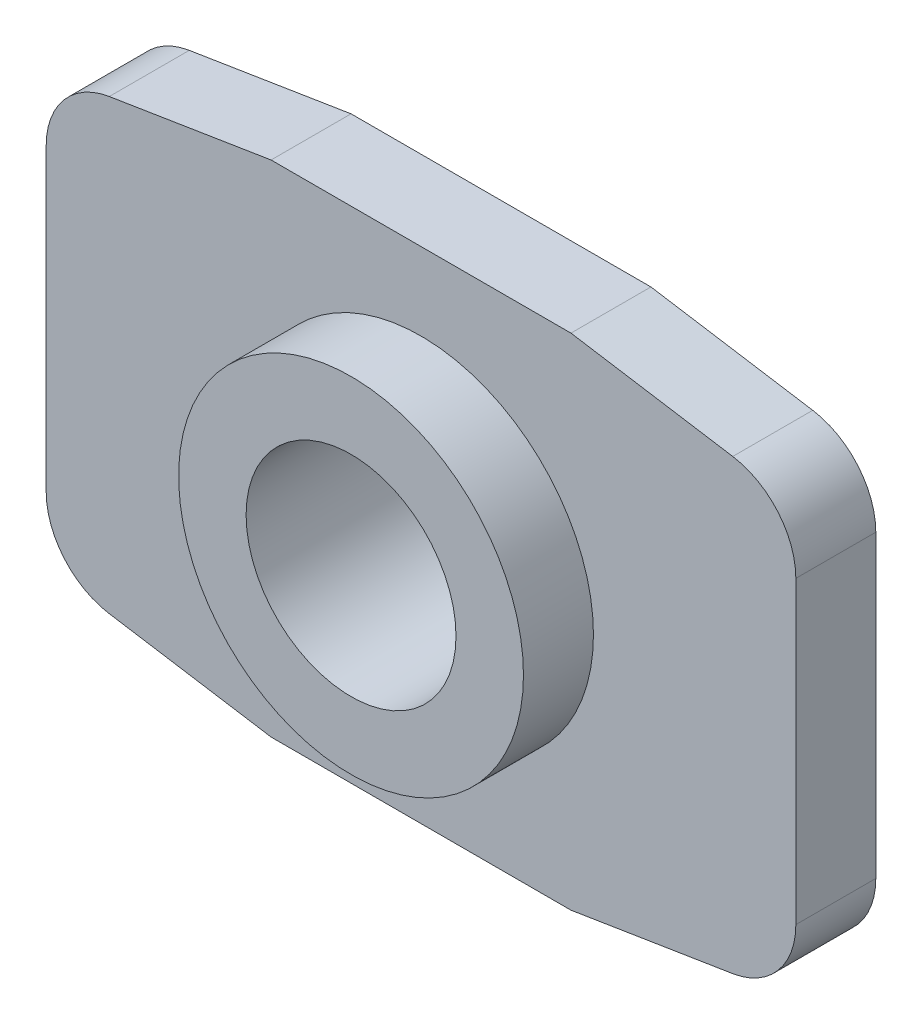
ISO-10303-21;
HEADER;
FILE_DESCRIPTION(('STEP AP214'),'2;1');
FILE_NAME('part.step','',(''),(''),'','','');
FILE_SCHEMA(('AUTOMOTIVE_DESIGN { 1 0 10303 214 1 1 1 1 }'));
ENDSEC;
DATA;
#1=APPLICATION_CONTEXT('core data for automotive mechanical design processes');
#2=APPLICATION_PROTOCOL_DEFINITION('international standard','automotive_design',2000,#1);
#3=PRODUCT_CONTEXT('',#1,'mechanical');
#4=PRODUCT('Part','Part','',(#3));
#5=PRODUCT_RELATED_PRODUCT_CATEGORY('part','',(#4));
#6=PRODUCT_DEFINITION_FORMATION('','',#4);
#7=PRODUCT_DEFINITION_CONTEXT('part definition',#1,'design');
#8=PRODUCT_DEFINITION('design','',#6,#7);
#9=PRODUCT_DEFINITION_SHAPE('','',#8);
#10=(LENGTH_UNIT() NAMED_UNIT(*) SI_UNIT(.MILLI.,.METRE.));
#11=(NAMED_UNIT(*) PLANE_ANGLE_UNIT() SI_UNIT($,.RADIAN.));
#12=(NAMED_UNIT(*) SI_UNIT($,.STERADIAN.) SOLID_ANGLE_UNIT());
#13=UNCERTAINTY_MEASURE_WITH_UNIT(LENGTH_MEASURE(1.E-05),#10,'distance_accuracy_value','');
#14=(GEOMETRIC_REPRESENTATION_CONTEXT(3) GLOBAL_UNCERTAINTY_ASSIGNED_CONTEXT((#13)) GLOBAL_UNIT_ASSIGNED_CONTEXT((#10,
#11,#12)) REPRESENTATION_CONTEXT('',''));
#15=CARTESIAN_POINT('',(0.,0.,0.));
#16=DIRECTION('',(0.,0.,1.));
#17=DIRECTION('',(1.,0.,0.));
#18=AXIS2_PLACEMENT_3D('',#15,#16,#17);
#19=CARTESIAN_POINT('',(6.,3.,1.6));
#20=DIRECTION('',(0.,0.,1.));
#21=DIRECTION('',(1.,0.,0.));
#22=AXIS2_PLACEMENT_3D('',#19,#20,#21);
#23=PLANE('',#22);
#24=CARTESIAN_POINT('',(6.,3.,1.6));
#25=DIRECTION('',(0.,0.,1.));
#26=DIRECTION('',(1.,0.,0.));
#27=AXIS2_PLACEMENT_3D('',#24,#25,#26);
#28=CIRCLE('',#27,1.5);
#29=CARTESIAN_POINT('',(7.5,3.,1.6));
#30=VERTEX_POINT('',#29);
#31=CARTESIAN_POINT('',(6.23739675280407,4.48109512920611,1.6));
#32=VERTEX_POINT('',#31);
#33=EDGE_CURVE('E182',#30,#32,#28,.T.);
#34=ORIENTED_EDGE('',*,*,#33,.T.);
#35=DIRECTION('',(-0.987396752804077,0.158264501869385,0.));
#36=VECTOR('',#35,1.);
#37=CARTESIAN_POINT('',(6.23739675280407,4.48109512920611,1.6));
#38=LINE('',#37,#36);
#39=CARTESIAN_POINT('',(3.,5.,1.6));
#40=VERTEX_POINT('',#39);
#41=EDGE_CURVE('E110',#32,#40,#38,.T.);
#42=ORIENTED_EDGE('',*,*,#41,.T.);
#43=DIRECTION('',(-1.,0.,0.));
#44=VECTOR('',#43,1.);
#45=CARTESIAN_POINT('',(-3.,5.,1.6));
#46=LINE('',#45,#44);
#47=CARTESIAN_POINT('',(-3.,5.,1.6));
#48=VERTEX_POINT('',#47);
#49=EDGE_CURVE('E209',#40,#48,#46,.T.);
#50=ORIENTED_EDGE('',*,*,#49,.T.);
#51=DIRECTION('',(-0.987396752804077,-0.158264501869386,0.));
#52=VECTOR('',#51,1.);
#53=CARTESIAN_POINT('',(-6.23739675280407,4.48109512920611,1.6));
#54=LINE('',#53,#52);
#55=CARTESIAN_POINT('',(-6.23739675280407,4.48109512920611,1.6));
#56=VERTEX_POINT('',#55);
#57=EDGE_CURVE('E227',#48,#56,#54,.T.);
#58=ORIENTED_EDGE('',*,*,#57,.T.);
#59=CARTESIAN_POINT('',(-6.,3.,1.6));
#60=DIRECTION('',(0.,0.,1.));
#61=DIRECTION('',(-1.,0.,0.));
#62=AXIS2_PLACEMENT_3D('',#59,#60,#61);
#63=CIRCLE('',#62,1.5);
#64=CARTESIAN_POINT('',(-7.5,3.,1.6));
#65=VERTEX_POINT('',#64);
#66=EDGE_CURVE('E224',#56,#65,#63,.T.);
#67=ORIENTED_EDGE('',*,*,#66,.T.);
#68=DIRECTION('',(0.,-1.,0.));
#69=VECTOR('',#68,1.);
#70=CARTESIAN_POINT('',(-7.5,-3.,1.6));
#71=LINE('',#70,#69);
#72=CARTESIAN_POINT('',(-7.5,-3.,1.6));
#73=VERTEX_POINT('',#72);
#74=EDGE_CURVE('E226',#65,#73,#71,.T.);
#75=ORIENTED_EDGE('',*,*,#74,.T.);
#76=CARTESIAN_POINT('',(-6.,-3.,1.6));
#77=DIRECTION('',(0.,0.,1.));
#78=DIRECTION('',(1.,0.,0.));
#79=AXIS2_PLACEMENT_3D('',#76,#77,#78);
#80=CIRCLE('',#79,1.5);
#81=CARTESIAN_POINT('',(-6.23739675280407,-4.48109512920612,1.6));
#82=VERTEX_POINT('',#81);
#83=EDGE_CURVE('E229',#73,#82,#80,.T.);
#84=ORIENTED_EDGE('',*,*,#83,.T.);
#85=DIRECTION('',(0.987396752804077,-0.158264501869385,0.));
#86=VECTOR('',#85,1.);
#87=CARTESIAN_POINT('',(-6.23739675280407,-4.48109512920612,1.6));
#88=LINE('',#87,#86);
#89=CARTESIAN_POINT('',(-3.,-5.,1.6));
#90=VERTEX_POINT('',#89);
#91=EDGE_CURVE('E235',#82,#90,#88,.T.);
#92=ORIENTED_EDGE('',*,*,#91,.T.);
#93=DIRECTION('',(1.,0.,0.));
#94=VECTOR('',#93,1.);
#95=CARTESIAN_POINT('',(-3.,-5.,1.6));
#96=LINE('',#95,#94);
#97=CARTESIAN_POINT('',(3.,-5.,1.6));
#98=VERTEX_POINT('',#97);
#99=EDGE_CURVE('E141',#90,#98,#96,.T.);
#100=ORIENTED_EDGE('',*,*,#99,.T.);
#101=DIRECTION('',(0.987396752804077,0.158264501869385,0.));
#102=VECTOR('',#101,1.);
#103=CARTESIAN_POINT('',(6.23739675280407,-4.48109512920611,1.6));
#104=LINE('',#103,#102);
#105=CARTESIAN_POINT('',(6.23739675280407,-4.48109512920612,1.6));
#106=VERTEX_POINT('',#105);
#107=EDGE_CURVE('E135',#98,#106,#104,.T.);
#108=ORIENTED_EDGE('',*,*,#107,.T.);
#109=CARTESIAN_POINT('',(6.,-3.,1.6));
#110=DIRECTION('',(0.,0.,1.));
#111=DIRECTION('',(-1.,0.,0.));
#112=AXIS2_PLACEMENT_3D('',#109,#110,#111);
#113=CIRCLE('',#112,1.5);
#114=CARTESIAN_POINT('',(7.5,-3.,1.6));
#115=VERTEX_POINT('',#114);
#116=EDGE_CURVE('E139',#106,#115,#113,.T.);
#117=ORIENTED_EDGE('',*,*,#116,.T.);
#118=DIRECTION('',(0.,1.,0.));
#119=VECTOR('',#118,1.);
#120=CARTESIAN_POINT('',(7.5,-3.,1.6));
#121=LINE('',#120,#119);
#122=EDGE_CURVE('E55',#115,#30,#121,.T.);
#123=ORIENTED_EDGE('',*,*,#122,.T.);
#124=EDGE_LOOP('',(#34,#42,#50,#58,#67,#75,#84,#92,#100,#108,#117,#123));
#125=FACE_BOUND('',#124,.T.);
#126=CARTESIAN_POINT('',(0.,0.,1.6));
#127=DIRECTION('',(0.,0.,1.));
#128=DIRECTION('',(1.,0.,0.));
#129=AXIS2_PLACEMENT_3D('',#126,#127,#128);
#130=CIRCLE('',#129,3.45);
#131=CARTESIAN_POINT('',(3.45,0.,1.6));
#132=VERTEX_POINT('',#131);
#133=EDGE_CURVE('E287',#132,#132,#130,.T.);
#134=ORIENTED_EDGE('',*,*,#133,.F.);
#135=EDGE_LOOP('',(#134));
#136=FACE_BOUND('',#135,.T.);
#137=ADVANCED_FACE('F38',(#125,#136),#23,.T.);
#138=CARTESIAN_POINT('',(6.,3.,1.6));
#139=DIRECTION('',(0.,0.,-1.));
#140=DIRECTION('',(-1.,0.,0.));
#141=AXIS2_PLACEMENT_3D('',#138,#139,#140);
#142=CYLINDRICAL_SURFACE('',#141,1.5);
#143=CARTESIAN_POINT('',(6.,3.,0.));
#144=DIRECTION('',(0.,0.,1.));
#145=DIRECTION('',(1.,0.,0.));
#146=AXIS2_PLACEMENT_3D('',#143,#144,#145);
#147=CIRCLE('',#146,1.5);
#148=CARTESIAN_POINT('',(7.5,3.,0.));
#149=VERTEX_POINT('',#148);
#150=CARTESIAN_POINT('',(6.23739675280407,4.48109512920611,0.));
#151=VERTEX_POINT('',#150);
#152=EDGE_CURVE('E159',#149,#151,#147,.T.);
#153=ORIENTED_EDGE('',*,*,#152,.T.);
#154=DIRECTION('',(0.,0.,-1.));
#155=VECTOR('',#154,1.);
#156=CARTESIAN_POINT('',(6.23739675280407,4.48109512920611,1.6));
#157=LINE('',#156,#155);
#158=EDGE_CURVE('E11',#32,#151,#157,.T.);
#159=ORIENTED_EDGE('',*,*,#158,.F.);
#160=ORIENTED_EDGE('',*,*,#33,.F.);
#161=DIRECTION('',(0.,0.,-1.));
#162=VECTOR('',#161,1.);
#163=CARTESIAN_POINT('',(7.5,3.,1.6));
#164=LINE('',#163,#162);
#165=EDGE_CURVE('E155',#30,#149,#164,.T.);
#166=ORIENTED_EDGE('',*,*,#165,.T.);
#167=EDGE_LOOP('',(#153,#159,#160,#166));
#168=FACE_BOUND('',#167,.T.);
#169=ADVANCED_FACE('F40',(#168),#142,.T.);
#170=CARTESIAN_POINT('',(6.23739675280407,4.48109512920611,1.6));
#171=DIRECTION('',(-0.158264501869385,-0.987396752804077,0.));
#172=DIRECTION('',(0.987396752804077,-0.158264501869385,0.));
#173=AXIS2_PLACEMENT_3D('',#170,#171,#172);
#174=PLANE('',#173);
#175=DIRECTION('',(-0.987396752804077,0.158264501869385,0.));
#176=VECTOR('',#175,1.);
#177=CARTESIAN_POINT('',(6.23739675280407,4.48109512920611,0.));
#178=LINE('',#177,#176);
#179=CARTESIAN_POINT('',(3.,5.,0.));
#180=VERTEX_POINT('',#179);
#181=EDGE_CURVE('E162',#151,#180,#178,.T.);
#182=ORIENTED_EDGE('',*,*,#181,.T.);
#183=DIRECTION('',(0.,0.,-1.));
#184=VECTOR('',#183,1.);
#185=CARTESIAN_POINT('',(3.,5.,1.6));
#186=LINE('',#185,#184);
#187=EDGE_CURVE('E47',#40,#180,#186,.T.);
#188=ORIENTED_EDGE('',*,*,#187,.F.);
#189=ORIENTED_EDGE('',*,*,#41,.F.);
#190=ORIENTED_EDGE('',*,*,#158,.T.);
#191=EDGE_LOOP('',(#182,#188,#189,#190));
#192=FACE_BOUND('',#191,.T.);
#193=ADVANCED_FACE('F265',(#192),#174,.F.);
#194=CARTESIAN_POINT('',(-3.,5.,1.6));
#195=DIRECTION('',(0.,-1.,0.));
#196=DIRECTION('',(0.,0.,-1.));
#197=AXIS2_PLACEMENT_3D('',#194,#195,#196);
#198=PLANE('',#197);
#199=DIRECTION('',(-1.,0.,0.));
#200=VECTOR('',#199,1.);
#201=CARTESIAN_POINT('',(-3.,5.,0.));
#202=LINE('',#201,#200);
#203=CARTESIAN_POINT('',(-3.,5.,0.));
#204=VERTEX_POINT('',#203);
#205=EDGE_CURVE('E165',#180,#204,#202,.T.);
#206=ORIENTED_EDGE('',*,*,#205,.T.);
#207=DIRECTION('',(0.,0.,-1.));
#208=VECTOR('',#207,1.);
#209=CARTESIAN_POINT('',(-3.,5.,1.6));
#210=LINE('',#209,#208);
#211=EDGE_CURVE('E201',#48,#204,#210,.T.);
#212=ORIENTED_EDGE('',*,*,#211,.F.);
#213=ORIENTED_EDGE('',*,*,#49,.F.);
#214=ORIENTED_EDGE('',*,*,#187,.T.);
#215=EDGE_LOOP('',(#206,#212,#213,#214));
#216=FACE_BOUND('',#215,.T.);
#217=ADVANCED_FACE('F207',(#216),#198,.F.);
#218=CARTESIAN_POINT('',(-6.23739675280407,4.48109512920611,1.6));
#219=DIRECTION('',(0.158264501869386,-0.987396752804077,0.));
#220=DIRECTION('',(0.987396752804077,0.158264501869386,0.));
#221=AXIS2_PLACEMENT_3D('',#218,#219,#220);
#222=PLANE('',#221);
#223=DIRECTION('',(-0.987396752804077,-0.158264501869386,0.));
#224=VECTOR('',#223,1.);
#225=CARTESIAN_POINT('',(-6.23739675280407,4.48109512920611,0.));
#226=LINE('',#225,#224);
#227=CARTESIAN_POINT('',(-6.23739675280407,4.48109512920611,0.));
#228=VERTEX_POINT('',#227);
#229=EDGE_CURVE('E167',#204,#228,#226,.T.);
#230=ORIENTED_EDGE('',*,*,#229,.T.);
#231=DIRECTION('',(0.,0.,-1.));
#232=VECTOR('',#231,1.);
#233=CARTESIAN_POINT('',(-6.23739675280407,4.48109512920611,1.6));
#234=LINE('',#233,#232);
#235=EDGE_CURVE('E198',#56,#228,#234,.T.);
#236=ORIENTED_EDGE('',*,*,#235,.F.);
#237=ORIENTED_EDGE('',*,*,#57,.F.);
#238=ORIENTED_EDGE('',*,*,#211,.T.);
#239=EDGE_LOOP('',(#230,#236,#237,#238));
#240=FACE_BOUND('',#239,.T.);
#241=ADVANCED_FACE('F218',(#240),#222,.F.);
#242=CARTESIAN_POINT('',(-6.,3.,1.6));
#243=DIRECTION('',(0.,0.,-1.));
#244=DIRECTION('',(-1.,0.,0.));
#245=AXIS2_PLACEMENT_3D('',#242,#243,#244);
#246=CYLINDRICAL_SURFACE('',#245,1.5);
#247=CARTESIAN_POINT('',(-6.,3.,0.));
#248=DIRECTION('',(0.,0.,1.));
#249=DIRECTION('',(-1.,0.,0.));
#250=AXIS2_PLACEMENT_3D('',#247,#248,#249);
#251=CIRCLE('',#250,1.5);
#252=CARTESIAN_POINT('',(-7.5,3.,0.));
#253=VERTEX_POINT('',#252);
#254=EDGE_CURVE('E169',#228,#253,#251,.T.);
#255=ORIENTED_EDGE('',*,*,#254,.T.);
#256=DIRECTION('',(0.,0.,-1.));
#257=VECTOR('',#256,1.);
#258=CARTESIAN_POINT('',(-7.5,3.,1.6));
#259=LINE('',#258,#257);
#260=EDGE_CURVE('E195',#65,#253,#259,.T.);
#261=ORIENTED_EDGE('',*,*,#260,.F.);
#262=ORIENTED_EDGE('',*,*,#66,.F.);
#263=ORIENTED_EDGE('',*,*,#235,.T.);
#264=EDGE_LOOP('',(#255,#261,#262,#263));
#265=FACE_BOUND('',#264,.T.);
#266=ADVANCED_FACE('F222',(#265),#246,.T.);
#267=CARTESIAN_POINT('',(-7.5,-3.,1.6));
#268=DIRECTION('',(1.,0.,0.));
#269=DIRECTION('',(0.,0.,-1.));
#270=AXIS2_PLACEMENT_3D('',#267,#268,#269);
#271=PLANE('',#270);
#272=DIRECTION('',(0.,-1.,0.));
#273=VECTOR('',#272,1.);
#274=CARTESIAN_POINT('',(-7.5,-3.,0.));
#275=LINE('',#274,#273);
#276=CARTESIAN_POINT('',(-7.5,-3.,0.));
#277=VERTEX_POINT('',#276);
#278=EDGE_CURVE('E171',#253,#277,#275,.T.);
#279=ORIENTED_EDGE('',*,*,#278,.T.);
#280=DIRECTION('',(0.,0.,-1.));
#281=VECTOR('',#280,1.);
#282=CARTESIAN_POINT('',(-7.5,-3.,1.6));
#283=LINE('',#282,#281);
#284=EDGE_CURVE('E192',#73,#277,#283,.T.);
#285=ORIENTED_EDGE('',*,*,#284,.F.);
#286=ORIENTED_EDGE('',*,*,#74,.F.);
#287=ORIENTED_EDGE('',*,*,#260,.T.);
#288=EDGE_LOOP('',(#279,#285,#286,#287));
#289=FACE_BOUND('',#288,.T.);
#290=ADVANCED_FACE('F329',(#289),#271,.F.);
#291=CARTESIAN_POINT('',(-6.,-3.,1.6));
#292=DIRECTION('',(0.,0.,-1.));
#293=DIRECTION('',(-1.,0.,0.));
#294=AXIS2_PLACEMENT_3D('',#291,#292,#293);
#295=CYLINDRICAL_SURFACE('',#294,1.5);
#296=CARTESIAN_POINT('',(-6.,-3.,0.));
#297=DIRECTION('',(0.,0.,1.));
#298=DIRECTION('',(1.,0.,0.));
#299=AXIS2_PLACEMENT_3D('',#296,#297,#298);
#300=CIRCLE('',#299,1.5);
#301=CARTESIAN_POINT('',(-6.23739675280407,-4.48109512920612,0.));
#302=VERTEX_POINT('',#301);
#303=EDGE_CURVE('E173',#277,#302,#300,.T.);
#304=ORIENTED_EDGE('',*,*,#303,.T.);
#305=DIRECTION('',(0.,0.,-1.));
#306=VECTOR('',#305,1.);
#307=CARTESIAN_POINT('',(-6.23739675280407,-4.48109512920612,1.6));
#308=LINE('',#307,#306);
#309=EDGE_CURVE('E189',#82,#302,#308,.T.);
#310=ORIENTED_EDGE('',*,*,#309,.F.);
#311=ORIENTED_EDGE('',*,*,#83,.F.);
#312=ORIENTED_EDGE('',*,*,#284,.T.);
#313=EDGE_LOOP('',(#304,#310,#311,#312));
#314=FACE_BOUND('',#313,.T.);
#315=ADVANCED_FACE('F333',(#314),#295,.T.);
#316=CARTESIAN_POINT('',(-6.23739675280407,-4.48109512920612,1.6));
#317=DIRECTION('',(0.158264501869385,0.987396752804077,0.));
#318=DIRECTION('',(-0.987396752804077,0.158264501869385,0.));
#319=AXIS2_PLACEMENT_3D('',#316,#317,#318);
#320=PLANE('',#319);
#321=DIRECTION('',(0.987396752804077,-0.158264501869385,0.));
#322=VECTOR('',#321,1.);
#323=CARTESIAN_POINT('',(-6.23739675280407,-4.48109512920612,0.));
#324=LINE('',#323,#322);
#325=CARTESIAN_POINT('',(-3.,-5.,0.));
#326=VERTEX_POINT('',#325);
#327=EDGE_CURVE('E175',#302,#326,#324,.T.);
#328=ORIENTED_EDGE('',*,*,#327,.T.);
#329=DIRECTION('',(0.,0.,-1.));
#330=VECTOR('',#329,1.);
#331=CARTESIAN_POINT('',(-3.,-5.,1.6));
#332=LINE('',#331,#330);
#333=EDGE_CURVE('E186',#90,#326,#332,.T.);
#334=ORIENTED_EDGE('',*,*,#333,.F.);
#335=ORIENTED_EDGE('',*,*,#91,.F.);
#336=ORIENTED_EDGE('',*,*,#309,.T.);
#337=EDGE_LOOP('',(#328,#334,#335,#336));
#338=FACE_BOUND('',#337,.T.);
#339=ADVANCED_FACE('F241',(#338),#320,.F.);
#340=CARTESIAN_POINT('',(-3.,-5.,1.6));
#341=DIRECTION('',(0.,1.,0.));
#342=DIRECTION('',(0.,0.,1.));
#343=AXIS2_PLACEMENT_3D('',#340,#341,#342);
#344=PLANE('',#343);
#345=DIRECTION('',(1.,0.,0.));
#346=VECTOR('',#345,1.);
#347=CARTESIAN_POINT('',(-3.,-5.,0.));
#348=LINE('',#347,#346);
#349=CARTESIAN_POINT('',(3.,-5.,0.));
#350=VERTEX_POINT('',#349);
#351=EDGE_CURVE('E177',#326,#350,#348,.T.);
#352=ORIENTED_EDGE('',*,*,#351,.T.);
#353=DIRECTION('',(0.,0.,-1.));
#354=VECTOR('',#353,1.);
#355=CARTESIAN_POINT('',(3.,-5.,1.6));
#356=LINE('',#355,#354);
#357=EDGE_CURVE('E150',#98,#350,#356,.T.);
#358=ORIENTED_EDGE('',*,*,#357,.F.);
#359=ORIENTED_EDGE('',*,*,#99,.F.);
#360=ORIENTED_EDGE('',*,*,#333,.T.);
#361=EDGE_LOOP('',(#352,#358,#359,#360));
#362=FACE_BOUND('',#361,.T.);
#363=ADVANCED_FACE('F245',(#362),#344,.F.);
#364=CARTESIAN_POINT('',(6.23739675280407,-4.48109512920611,1.6));
#365=DIRECTION('',(-0.158264501869385,0.987396752804077,0.));
#366=DIRECTION('',(-0.987396752804077,-0.158264501869385,0.));
#367=AXIS2_PLACEMENT_3D('',#364,#365,#366);
#368=PLANE('',#367);
#369=DIRECTION('',(0.987396752804077,0.158264501869385,0.));
#370=VECTOR('',#369,1.);
#371=CARTESIAN_POINT('',(6.23739675280407,-4.48109512920611,0.));
#372=LINE('',#371,#370);
#373=CARTESIAN_POINT('',(6.23739675280407,-4.48109512920612,0.));
#374=VERTEX_POINT('',#373);
#375=EDGE_CURVE('E149',#350,#374,#372,.T.);
#376=ORIENTED_EDGE('',*,*,#375,.T.);
#377=DIRECTION('',(0.,0.,-1.));
#378=VECTOR('',#377,1.);
#379=CARTESIAN_POINT('',(6.23739675280407,-4.48109512920612,1.6));
#380=LINE('',#379,#378);
#381=EDGE_CURVE('E146',#106,#374,#380,.T.);
#382=ORIENTED_EDGE('',*,*,#381,.F.);
#383=ORIENTED_EDGE('',*,*,#107,.F.);
#384=ORIENTED_EDGE('',*,*,#357,.T.);
#385=EDGE_LOOP('',(#376,#382,#383,#384));
#386=FACE_BOUND('',#385,.T.);
#387=ADVANCED_FACE('F147',(#386),#368,.F.);
#388=CARTESIAN_POINT('',(6.,-3.,1.6));
#389=DIRECTION('',(0.,0.,-1.));
#390=DIRECTION('',(-1.,0.,0.));
#391=AXIS2_PLACEMENT_3D('',#388,#389,#390);
#392=CYLINDRICAL_SURFACE('',#391,1.5);
#393=CARTESIAN_POINT('',(6.,-3.,0.));
#394=DIRECTION('',(0.,0.,1.));
#395=DIRECTION('',(-1.,0.,0.));
#396=AXIS2_PLACEMENT_3D('',#393,#394,#395);
#397=CIRCLE('',#396,1.5);
#398=CARTESIAN_POINT('',(7.5,-3.,0.));
#399=VERTEX_POINT('',#398);
#400=EDGE_CURVE('E96',#374,#399,#397,.T.);
#401=ORIENTED_EDGE('',*,*,#400,.T.);
#402=DIRECTION('',(0.,0.,-1.));
#403=VECTOR('',#402,1.);
#404=CARTESIAN_POINT('',(7.5,-3.,1.6));
#405=LINE('',#404,#403);
#406=EDGE_CURVE('E151',#115,#399,#405,.T.);
#407=ORIENTED_EDGE('',*,*,#406,.F.);
#408=ORIENTED_EDGE('',*,*,#116,.F.);
#409=ORIENTED_EDGE('',*,*,#381,.T.);
#410=EDGE_LOOP('',(#401,#407,#408,#409));
#411=FACE_BOUND('',#410,.T.);
#412=ADVANCED_FACE('F153',(#411),#392,.T.);
#413=CARTESIAN_POINT('',(7.5,-3.,1.6));
#414=DIRECTION('',(-1.,0.,0.));
#415=DIRECTION('',(0.,-1.,0.));
#416=AXIS2_PLACEMENT_3D('',#413,#414,#415);
#417=PLANE('',#416);
#418=DIRECTION('',(0.,1.,0.));
#419=VECTOR('',#418,1.);
#420=CARTESIAN_POINT('',(7.5,-3.,0.));
#421=LINE('',#420,#419);
#422=EDGE_CURVE('E102',#399,#149,#421,.T.);
#423=ORIENTED_EDGE('',*,*,#422,.T.);
#424=ORIENTED_EDGE('',*,*,#165,.F.);
#425=ORIENTED_EDGE('',*,*,#122,.F.);
#426=ORIENTED_EDGE('',*,*,#406,.T.);
#427=EDGE_LOOP('',(#423,#424,#425,#426));
#428=FACE_BOUND('',#427,.T.);
#429=ADVANCED_FACE('F249',(#428),#417,.F.);
#430=CARTESIAN_POINT('',(6.,3.,0.));
#431=DIRECTION('',(0.,0.,1.));
#432=DIRECTION('',(1.,0.,0.));
#433=AXIS2_PLACEMENT_3D('',#430,#431,#432);
#434=PLANE('',#433);
#435=CARTESIAN_POINT('',(0.,0.,0.));
#436=DIRECTION('',(0.,0.,1.));
#437=DIRECTION('',(1.,0.,0.));
#438=AXIS2_PLACEMENT_3D('',#435,#436,#437);
#439=CIRCLE('',#438,2.1);
#440=CARTESIAN_POINT('',(2.1,0.,0.));
#441=VERTEX_POINT('',#440);
#442=EDGE_CURVE('E282',#441,#441,#439,.T.);
#443=ORIENTED_EDGE('',*,*,#442,.T.);
#444=EDGE_LOOP('',(#443));
#445=FACE_BOUND('',#444,.T.);
#446=ORIENTED_EDGE('',*,*,#152,.F.);
#447=ORIENTED_EDGE('',*,*,#422,.F.);
#448=ORIENTED_EDGE('',*,*,#400,.F.);
#449=ORIENTED_EDGE('',*,*,#375,.F.);
#450=ORIENTED_EDGE('',*,*,#351,.F.);
#451=ORIENTED_EDGE('',*,*,#327,.F.);
#452=ORIENTED_EDGE('',*,*,#303,.F.);
#453=ORIENTED_EDGE('',*,*,#278,.F.);
#454=ORIENTED_EDGE('',*,*,#254,.F.);
#455=ORIENTED_EDGE('',*,*,#229,.F.);
#456=ORIENTED_EDGE('',*,*,#205,.F.);
#457=ORIENTED_EDGE('',*,*,#181,.F.);
#458=EDGE_LOOP('',(#446,#447,#448,#449,#450,#451,#452,#453,#454,#455,#456,#457));
#459=FACE_BOUND('',#458,.T.);
#460=ADVANCED_FACE('F213',(#445,#459),#434,.F.);
#461=CARTESIAN_POINT('',(0.,0.,3.));
#462=DIRECTION('',(0.,0.,-1.));
#463=DIRECTION('',(-1.,0.,0.));
#464=AXIS2_PLACEMENT_3D('',#461,#462,#463);
#465=CYLINDRICAL_SURFACE('',#464,3.45);
#466=CARTESIAN_POINT('',(0.,0.,3.));
#467=DIRECTION('',(0.,0.,1.));
#468=DIRECTION('',(1.,0.,0.));
#469=AXIS2_PLACEMENT_3D('',#466,#467,#468);
#470=CIRCLE('',#469,3.45);
#471=CARTESIAN_POINT('',(3.45,0.,3.));
#472=VERTEX_POINT('',#471);
#473=EDGE_CURVE('E163',#472,#472,#470,.T.);
#474=ORIENTED_EDGE('',*,*,#473,.F.);
#475=EDGE_LOOP('',(#474));
#476=FACE_BOUND('',#475,.T.);
#477=ORIENTED_EDGE('',*,*,#133,.T.);
#478=EDGE_LOOP('',(#477));
#479=FACE_BOUND('',#478,.T.);
#480=ADVANCED_FACE('F256',(#476,#479),#465,.T.);
#481=CARTESIAN_POINT('',(0.,0.,3.));
#482=DIRECTION('',(0.,0.,1.));
#483=DIRECTION('',(1.,0.,0.));
#484=AXIS2_PLACEMENT_3D('',#481,#482,#483);
#485=PLANE('',#484);
#486=CARTESIAN_POINT('',(0.,0.,3.));
#487=DIRECTION('',(0.,0.,1.));
#488=DIRECTION('',(1.,0.,0.));
#489=AXIS2_PLACEMENT_3D('',#486,#487,#488);
#490=CIRCLE('',#489,2.09999999999999);
#491=CARTESIAN_POINT('',(2.09999999999999,0.,3.));
#492=VERTEX_POINT('',#491);
#493=EDGE_CURVE('E285',#492,#492,#490,.T.);
#494=ORIENTED_EDGE('',*,*,#493,.F.);
#495=EDGE_LOOP('',(#494));
#496=FACE_BOUND('',#495,.T.);
#497=ORIENTED_EDGE('',*,*,#473,.T.);
#498=EDGE_LOOP('',(#497));
#499=FACE_BOUND('',#498,.T.);
#500=ADVANCED_FACE('F269',(#496,#499),#485,.T.);
#501=CARTESIAN_POINT('',(0.,0.,3.));
#502=DIRECTION('',(0.,0.,1.));
#503=DIRECTION('',(1.,0.,0.));
#504=AXIS2_PLACEMENT_3D('',#501,#502,#503);
#505=CYLINDRICAL_SURFACE('',#504,2.09999999999999);
#506=ORIENTED_EDGE('',*,*,#442,.F.);
#507=EDGE_LOOP('',(#506));
#508=FACE_BOUND('',#507,.T.);
#509=ORIENTED_EDGE('',*,*,#493,.T.);
#510=EDGE_LOOP('',(#509));
#511=FACE_BOUND('',#510,.T.);
#512=ADVANCED_FACE('F273',(#508,#511),#505,.F.);
#513=CLOSED_SHELL('',(#137,#169,#193,#217,#241,#266,#290,#315,#339,#363,#387,#412,#429,#460,
#480,#500,#512));
#514=MANIFOLD_SOLID_BREP('B2',#513);
#515=ADVANCED_BREP_SHAPE_REPRESENTATION('',(#18,#514),#14);
#516=SHAPE_DEFINITION_REPRESENTATION(#9,#515);
ENDSEC;
END-ISO-10303-21;
